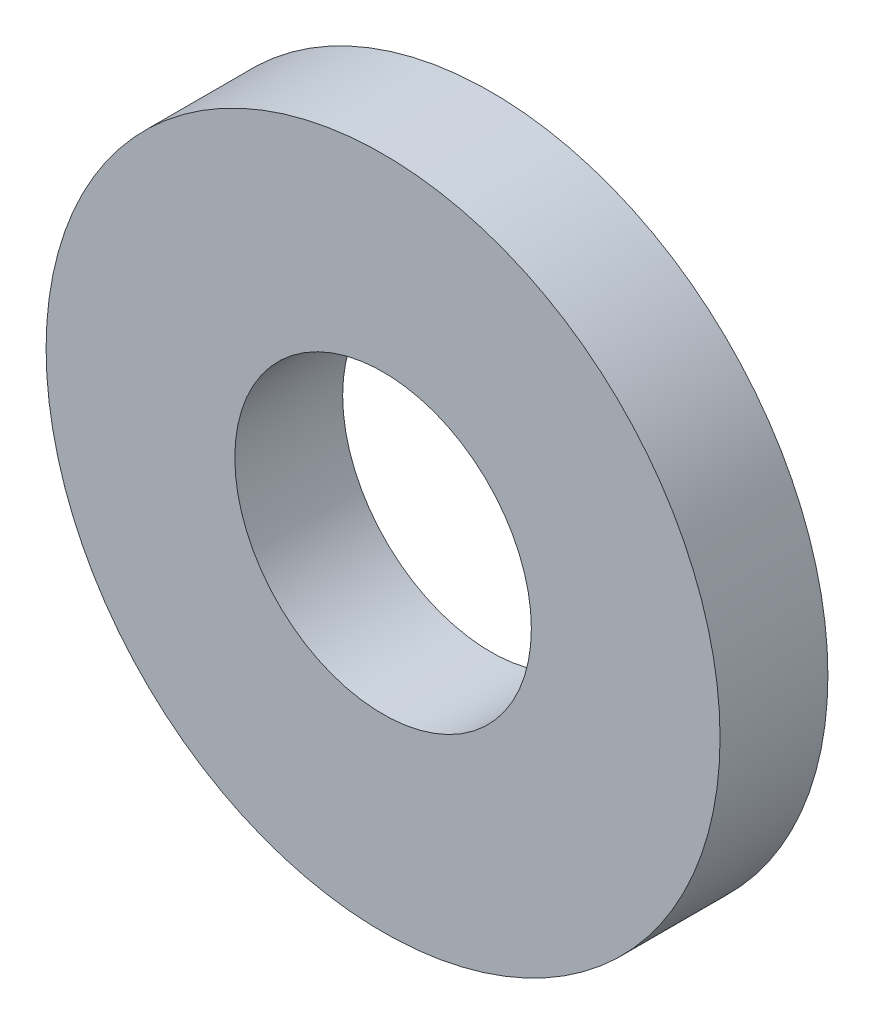
ISO-10303-21;
HEADER;
FILE_DESCRIPTION(('STEP AP214'),'2;1');
FILE_NAME('part.step','',(''),(''),'','','');
FILE_SCHEMA(('AUTOMOTIVE_DESIGN { 1 0 10303 214 1 1 1 1 }'));
ENDSEC;
DATA;
#1=APPLICATION_CONTEXT('core data for automotive mechanical design processes');
#2=APPLICATION_PROTOCOL_DEFINITION('international standard','automotive_design',2000,#1);
#3=PRODUCT_CONTEXT('',#1,'mechanical');
#4=PRODUCT('Part','Part','',(#3));
#5=PRODUCT_RELATED_PRODUCT_CATEGORY('part','',(#4));
#6=PRODUCT_DEFINITION_FORMATION('','',#4);
#7=PRODUCT_DEFINITION_CONTEXT('part definition',#1,'design');
#8=PRODUCT_DEFINITION('design','',#6,#7);
#9=PRODUCT_DEFINITION_SHAPE('','',#8);
#10=(LENGTH_UNIT() NAMED_UNIT(*) SI_UNIT(.MILLI.,.METRE.));
#11=(NAMED_UNIT(*) PLANE_ANGLE_UNIT() SI_UNIT($,.RADIAN.));
#12=(NAMED_UNIT(*) SI_UNIT($,.STERADIAN.) SOLID_ANGLE_UNIT());
#13=UNCERTAINTY_MEASURE_WITH_UNIT(LENGTH_MEASURE(1.E-05),#10,'distance_accuracy_value','');
#14=(GEOMETRIC_REPRESENTATION_CONTEXT(3) GLOBAL_UNCERTAINTY_ASSIGNED_CONTEXT((#13)) GLOBAL_UNIT_ASSIGNED_CONTEXT((#10,
#11,#12)) REPRESENTATION_CONTEXT('',''));
#15=CARTESIAN_POINT('',(0.,0.,0.));
#16=DIRECTION('',(0.,0.,1.));
#17=DIRECTION('',(1.,0.,0.));
#18=AXIS2_PLACEMENT_3D('',#15,#16,#17);
#19=CARTESIAN_POINT('',(0.,0.,0.4));
#20=DIRECTION('',(0.,0.,1.));
#21=DIRECTION('',(1.,0.,0.));
#22=AXIS2_PLACEMENT_3D('',#19,#20,#21);
#23=PLANE('',#22);
#24=CARTESIAN_POINT('',(0.,0.,0.4));
#25=DIRECTION('',(0.,0.,1.));
#26=DIRECTION('',(1.,0.,0.));
#27=AXIS2_PLACEMENT_3D('',#24,#25,#26);
#28=CIRCLE('',#27,2.5);
#29=CARTESIAN_POINT('',(2.5,0.,0.4));
#30=VERTEX_POINT('',#29);
#31=EDGE_CURVE('E10',#30,#30,#28,.T.);
#32=ORIENTED_EDGE('',*,*,#31,.T.);
#33=EDGE_LOOP('',(#32));
#34=FACE_BOUND('',#33,.T.);
#35=CARTESIAN_POINT('',(0.,0.,0.4));
#36=DIRECTION('',(0.,0.,1.));
#37=DIRECTION('',(1.,0.,0.));
#38=AXIS2_PLACEMENT_3D('',#35,#36,#37);
#39=CIRCLE('',#38,1.1);
#40=CARTESIAN_POINT('',(1.1,0.,0.4));
#41=VERTEX_POINT('',#40);
#42=EDGE_CURVE('E41',#41,#41,#39,.T.);
#43=ORIENTED_EDGE('',*,*,#42,.F.);
#44=EDGE_LOOP('',(#43));
#45=FACE_BOUND('',#44,.T.);
#46=ADVANCED_FACE('F30',(#34,#45),#23,.T.);
#47=CARTESIAN_POINT('',(0.,0.,-0.4));
#48=DIRECTION('',(0.,0.,1.));
#49=DIRECTION('',(1.,0.,0.));
#50=AXIS2_PLACEMENT_3D('',#47,#48,#49);
#51=PLANE('',#50);
#52=CARTESIAN_POINT('',(0.,0.,-0.4));
#53=DIRECTION('',(0.,0.,1.));
#54=DIRECTION('',(1.,0.,0.));
#55=AXIS2_PLACEMENT_3D('',#52,#53,#54);
#56=CIRCLE('',#55,2.5);
#57=CARTESIAN_POINT('',(2.5,0.,-0.4));
#58=VERTEX_POINT('',#57);
#59=EDGE_CURVE('E34',#58,#58,#56,.T.);
#60=ORIENTED_EDGE('',*,*,#59,.F.);
#61=EDGE_LOOP('',(#60));
#62=FACE_BOUND('',#61,.T.);
#63=CARTESIAN_POINT('',(0.,0.,-0.4));
#64=DIRECTION('',(0.,0.,1.));
#65=DIRECTION('',(1.,0.,0.));
#66=AXIS2_PLACEMENT_3D('',#63,#64,#65);
#67=CIRCLE('',#66,1.1);
#68=CARTESIAN_POINT('',(1.1,0.,-0.4));
#69=VERTEX_POINT('',#68);
#70=EDGE_CURVE('E43',#69,#69,#67,.T.);
#71=ORIENTED_EDGE('',*,*,#70,.T.);
#72=EDGE_LOOP('',(#71));
#73=FACE_BOUND('',#72,.T.);
#74=ADVANCED_FACE('F53',(#62,#73),#51,.F.);
#75=CARTESIAN_POINT('',(0.,0.,0.4));
#76=DIRECTION('',(0.,0.,-1.));
#77=DIRECTION('',(-1.,0.,0.));
#78=AXIS2_PLACEMENT_3D('',#75,#76,#77);
#79=CYLINDRICAL_SURFACE('',#78,2.5);
#80=ORIENTED_EDGE('',*,*,#31,.F.);
#81=EDGE_LOOP('',(#80));
#82=FACE_BOUND('',#81,.T.);
#83=ORIENTED_EDGE('',*,*,#59,.T.);
#84=EDGE_LOOP('',(#83));
#85=FACE_BOUND('',#84,.T.);
#86=ADVANCED_FACE('F32',(#82,#85),#79,.T.);
#87=CARTESIAN_POINT('',(0.,0.,0.4));
#88=DIRECTION('',(0.,0.,-1.));
#89=DIRECTION('',(-1.,0.,0.));
#90=AXIS2_PLACEMENT_3D('',#87,#88,#89);
#91=CYLINDRICAL_SURFACE('',#90,1.1);
#92=ORIENTED_EDGE('',*,*,#42,.T.);
#93=EDGE_LOOP('',(#92));
#94=FACE_BOUND('',#93,.T.);
#95=ORIENTED_EDGE('',*,*,#70,.F.);
#96=EDGE_LOOP('',(#95));
#97=FACE_BOUND('',#96,.T.);
#98=ADVANCED_FACE('F49',(#94,#97),#91,.F.);
#99=CLOSED_SHELL('',(#46,#74,#86,#98));
#100=MANIFOLD_SOLID_BREP('B2',#99);
#101=ADVANCED_BREP_SHAPE_REPRESENTATION('',(#18,#100),#14);
#102=SHAPE_DEFINITION_REPRESENTATION(#9,#101);
ENDSEC;
END-ISO-10303-21;
